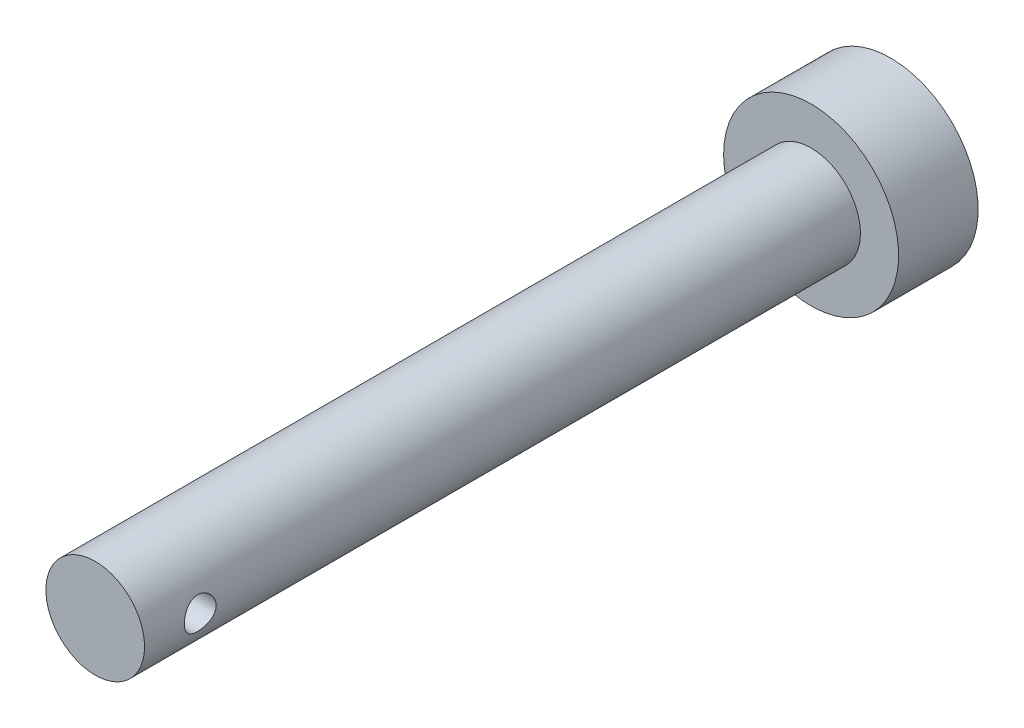
ISO-10303-21;
HEADER;
FILE_DESCRIPTION(('STEP AP214'),'2;1');
FILE_NAME('part.step','',(''),(''),'','','');
FILE_SCHEMA(('AUTOMOTIVE_DESIGN { 1 0 10303 214 1 1 1 1 }'));
ENDSEC;
DATA;
#1=APPLICATION_CONTEXT('core data for automotive mechanical design processes');
#2=APPLICATION_PROTOCOL_DEFINITION('international standard','automotive_design',2000,#1);
#3=PRODUCT_CONTEXT('',#1,'mechanical');
#4=PRODUCT('Part','Part','',(#3));
#5=PRODUCT_RELATED_PRODUCT_CATEGORY('part','',(#4));
#6=PRODUCT_DEFINITION_FORMATION('','',#4);
#7=PRODUCT_DEFINITION_CONTEXT('part definition',#1,'design');
#8=PRODUCT_DEFINITION('design','',#6,#7);
#9=PRODUCT_DEFINITION_SHAPE('','',#8);
#10=(LENGTH_UNIT() NAMED_UNIT(*) SI_UNIT(.MILLI.,.METRE.));
#11=(NAMED_UNIT(*) PLANE_ANGLE_UNIT() SI_UNIT($,.RADIAN.));
#12=(NAMED_UNIT(*) SI_UNIT($,.STERADIAN.) SOLID_ANGLE_UNIT());
#13=UNCERTAINTY_MEASURE_WITH_UNIT(LENGTH_MEASURE(1.E-05),#10,'distance_accuracy_value','');
#14=(GEOMETRIC_REPRESENTATION_CONTEXT(3) GLOBAL_UNCERTAINTY_ASSIGNED_CONTEXT((#13)) GLOBAL_UNIT_ASSIGNED_CONTEXT((#10,
#11,#12)) REPRESENTATION_CONTEXT('',''));
#15=CARTESIAN_POINT('',(0.,0.,0.));
#16=DIRECTION('',(0.,0.,1.));
#17=DIRECTION('',(1.,0.,0.));
#18=AXIS2_PLACEMENT_3D('',#15,#16,#17);
#19=CARTESIAN_POINT('',(0.,0.,45.));
#20=DIRECTION('',(0.,0.,-1.));
#21=DIRECTION('',(-1.,0.,0.));
#22=AXIS2_PLACEMENT_3D('',#19,#20,#21);
#23=CYLINDRICAL_SURFACE('',#22,3.1);
#24=CARTESIAN_POINT('',(-3.1,0.,40.5));
#25=CARTESIAN_POINT('',(-3.09999991732933,0.0546616928378481,40.5000000779756));
#26=CARTESIAN_POINT('',(-3.09854074383551,0.109324626027905,40.5044965335972));
#27=CARTESIAN_POINT('',(-3.09286313233695,0.217046394731187,40.5223126603245));
#28=CARTESIAN_POINT('',(-3.08864423243675,0.270104960165796,40.5356338084239));
#29=CARTESIAN_POINT('',(-3.07790688090447,0.373049270981988,40.5705994056249));
#30=CARTESIAN_POINT('',(-3.07139212676488,0.422939966664651,40.5922304765445));
#31=CARTESIAN_POINT('',(-3.05673203907304,0.518385805557841,40.643143276595));
#32=CARTESIAN_POINT('',(-3.04858641694504,0.563940179365319,40.6724263599999));
#33=CARTESIAN_POINT('',(-3.03122795920094,0.650909161248699,40.7388182781714));
#34=CARTESIAN_POINT('',(-3.02199075558346,0.692162305670849,40.776132218118));
#35=CARTESIAN_POINT('',(-3.00362795341575,0.767946996765762,40.8570902486727));
#36=CARTESIAN_POINT('',(-2.99450237775344,0.802477185933583,40.9007356146295));
#37=CARTESIAN_POINT('',(-2.97713144725325,0.864733161011551,40.9945418963536));
#38=CARTESIAN_POINT('',(-2.96891598960081,0.892253350457055,41.0448453251286));
#39=CARTESIAN_POINT('',(-2.95466389720521,0.938375319479866,41.1496742752733));
#40=CARTESIAN_POINT('',(-2.94862664562182,0.956979624412884,41.2041985960196));
#41=CARTESIAN_POINT('',(-2.9396702225274,0.984143780427318,41.3140926725762));
#42=CARTESIAN_POINT('',(-2.93665788132408,0.99300462017844,41.3693802171756));
#43=CARTESIAN_POINT('',(-2.93381620930014,1.00137095885894,41.4807329894575));
#44=CARTESIAN_POINT('',(-2.93398596783569,1.00087913430537,41.5367979900605));
#45=CARTESIAN_POINT('',(-2.93740735589061,0.99078869758625,41.645588119726));
#46=CARTESIAN_POINT('',(-2.94052787811318,0.981577483817591,41.6983540080824));
#47=CARTESIAN_POINT('',(-2.94928546572063,0.954939694345884,41.8015472010422));
#48=CARTESIAN_POINT('',(-2.95492281459322,0.937512193172744,41.8519742414985));
#49=CARTESIAN_POINT('',(-2.96817595683685,0.894672560822166,41.9499607400401));
#50=CARTESIAN_POINT('',(-2.97582076641868,0.869142073499799,41.9974643592104));
#51=CARTESIAN_POINT('',(-2.99221470175116,0.81090335738701,42.0876381018766));
#52=CARTESIAN_POINT('',(-3.00096412964128,0.778193162960507,42.1303068968505));
#53=CARTESIAN_POINT('',(-3.01910259490866,0.704641818516097,42.2117836911752));
#54=CARTESIAN_POINT('',(-3.0285020322448,0.663482313791419,42.2503025445807));
#55=CARTESIAN_POINT('',(-3.04650716560179,0.575171490035369,42.3199639150633));
#56=CARTESIAN_POINT('',(-3.05511279482185,0.52801966752911,42.3511058116976));
#57=CARTESIAN_POINT('',(-3.07066150642765,0.428478812163014,42.4053425591389));
#58=CARTESIAN_POINT('',(-3.07758933782193,0.376047454707776,42.4283644015228));
#59=CARTESIAN_POINT('',(-3.0888915225951,0.267780008434749,42.4651736095426));
#60=CARTESIAN_POINT('',(-3.09326670428871,0.211945030567731,42.4789639709356));
#61=CARTESIAN_POINT('',(-3.09883546017117,0.100906527818242,42.4964168420587));
#62=CARTESIAN_POINT('',(-3.10015181896368,0.0457705439581188,42.5004704348318));
#63=CARTESIAN_POINT('',(-3.09982018660884,-0.0644019846639804,42.4994427807207));
#64=CARTESIAN_POINT('',(-3.09817266024525,-0.119438543662587,42.4943629660982));
#65=CARTESIAN_POINT('',(-3.0921792527875,-0.226314427335924,42.4755245867189));
#66=CARTESIAN_POINT('',(-3.08790685930159,-0.278199907400526,42.462002223674));
#67=CARTESIAN_POINT('',(-3.07716867368517,-0.378948229242879,42.4269541884185));
#68=CARTESIAN_POINT('',(-3.07070260589543,-0.427810690232288,42.4054275103454));
#69=CARTESIAN_POINT('',(-3.05603411703274,-0.522504343922593,42.3543745150268));
#70=CARTESIAN_POINT('',(-3.04779185335867,-0.56822736703088,42.3246593322387));
#71=CARTESIAN_POINT('',(-3.03050981454519,-0.654167346628331,42.2582971311447));
#72=CARTESIAN_POINT('',(-3.02146981026828,-0.694382712615949,42.2216481177327));
#73=CARTESIAN_POINT('',(-3.00312715409019,-0.769937672744123,42.1406187524708));
#74=CARTESIAN_POINT('',(-2.99382961373558,-0.804998301572613,42.0959765142691));
#75=CARTESIAN_POINT('',(-2.97642049261311,-0.867160084432995,42.0012410266577));
#76=CARTESIAN_POINT('',(-2.96830890551494,-0.894261280951086,41.9511478063466));
#77=CARTESIAN_POINT('',(-2.95427571684034,-0.939584779805243,41.8469804192811));
#78=CARTESIAN_POINT('',(-2.94834741256436,-0.957834312467886,41.7929190582041));
#79=CARTESIAN_POINT('',(-2.93941897363932,-0.984897526937614,41.6822577537674));
#80=CARTESIAN_POINT('',(-2.93641762891512,-0.993715108285291,41.6256588696118));
#81=CARTESIAN_POINT('',(-2.93381458815353,-1.00137232277604,41.5144610481486));
#82=CARTESIAN_POINT('',(-2.93405610172574,-1.00067211468476,41.4598970953227));
#83=CARTESIAN_POINT('',(-2.93752743878588,-0.990434800076223,41.351706370633));
#84=CARTESIAN_POINT('',(-2.94075710520667,-0.980898158030969,41.2980795496614));
#85=CARTESIAN_POINT('',(-2.94972779399559,-0.953575367433496,41.1941676188352));
#86=CARTESIAN_POINT('',(-2.95542613218533,-0.935929134388619,41.1438417510491));
#87=CARTESIAN_POINT('',(-2.9686788226802,-0.892999646243258,41.0468254892021));
#88=CARTESIAN_POINT('',(-2.976233569577,-0.867714767236766,41.0001358708315));
#89=CARTESIAN_POINT('',(-2.99273704950311,-0.809005559218575,40.9096285081905));
#90=CARTESIAN_POINT('',(-3.00173047270294,-0.775288162939723,40.8660090505328));
#91=CARTESIAN_POINT('',(-3.01990141354045,-0.701177016271899,40.7848984488502));
#92=CARTESIAN_POINT('',(-3.02907898111945,-0.660781432603365,40.747408993255));
#93=CARTESIAN_POINT('',(-3.04697636303769,-0.572731312047682,40.6782816140783));
#94=CARTESIAN_POINT('',(-3.0556682369196,-0.524869500277994,40.6468996185803));
#95=CARTESIAN_POINT('',(-3.07125043822646,-0.424270928109886,40.5926650804752));
#96=CARTESIAN_POINT('',(-3.07814135769285,-0.371535777497287,40.5698097337792));
#97=CARTESIAN_POINT('',(-3.08896778011839,-0.266255500103288,40.534606875956));
#98=CARTESIAN_POINT('',(-3.09306744505299,-0.213924651837507,40.5216686224566));
#99=CARTESIAN_POINT('',(-3.09858327970547,-0.107729361043748,40.5043661557839));
#100=CARTESIAN_POINT('',(-3.10000008146617,-0.0538652827579416,40.4999999231605));
#101=CARTESIAN_POINT('',(-3.1,0.,40.5));
#102=B_SPLINE_CURVE_WITH_KNOTS('',3,(#24,#25,#26,#27,#28,#29,#30,#31,#32,#33,#34,#35,#36,#37,
#38,#39,#40,#41,#42,#43,#44,#45,#46,#47,#48,#49,#50,#51,#52,#53,#54,#55,#56,#57,#58,#59,#60,#61,
#62,#63,#64,#65,#66,#67,#68,#69,#70,#71,#72,#73,#74,#75,#76,#77,#78,#79,#80,#81,#82,#83,#84,#85,
#86,#87,#88,#89,#90,#91,#92,#93,#94,#95,#96,#97,#98,#99,#100,#101),.UNSPECIFIED.,.T.,.F.,(4,2,2,
2,2,2,2,2,2,2,2,2,2,2,2,2,2,2,2,2,2,2,2,2,2,2,2,2,2,2,2,2,2,2,2,2,2,2,4),(0.,0.163786977571213,
0.327601375188353,0.491153145030708,0.654733880339085,0.823132982457995,0.99156605268457,
1.16448270045611,1.33735034192778,1.50471321360198,1.67202819059899,1.8322419454362,
1.99247375081972,2.15516292888893,2.31789670313387,2.48855415146277,2.65922594793179,
2.83139534275185,3.00350883884293,3.16858437380868,3.33363402459453,3.49426103285019,
3.65490823313218,3.81962570567674,3.98439064549243,4.15614032639133,4.32788909050077,
4.49910609991181,4.67025229406715,4.83315473478927,4.9960486133097,5.15623187832752,
5.31644922082921,5.48328449671259,5.65016564808849,5.82298974464347,5.99575695575451,
6.15719562667167,6.31859626029481),.UNSPECIFIED.);
#103=CARTESIAN_POINT('',(-3.1,0.,40.5));
#104=VERTEX_POINT('',#103);
#105=EDGE_CURVE('E10',#104,#104,#102,.T.);
#106=ORIENTED_EDGE('',*,*,#105,.T.);
#107=EDGE_LOOP('',(#106));
#108=FACE_BOUND('',#107,.T.);
#109=CARTESIAN_POINT('',(3.1,0.,40.5));
#110=CARTESIAN_POINT('',(3.09999991732933,-0.0546616928378481,40.5000000779756));
#111=CARTESIAN_POINT('',(3.09854074383551,-0.109324626027905,40.5044965335972));
#112=CARTESIAN_POINT('',(3.09286313233695,-0.217046394731187,40.5223126603245));
#113=CARTESIAN_POINT('',(3.08864423243675,-0.270104960165796,40.5356338084239));
#114=CARTESIAN_POINT('',(3.07790688090447,-0.373049270981988,40.5705994056249));
#115=CARTESIAN_POINT('',(3.07139212676488,-0.422939966664651,40.5922304765445));
#116=CARTESIAN_POINT('',(3.05673203907304,-0.518385805557841,40.643143276595));
#117=CARTESIAN_POINT('',(3.04858641694504,-0.563940179365319,40.6724263599999));
#118=CARTESIAN_POINT('',(3.03122795920094,-0.650909161248698,40.7388182781714));
#119=CARTESIAN_POINT('',(3.02199075558346,-0.692162305670847,40.776132218118));
#120=CARTESIAN_POINT('',(3.00362795341575,-0.767946996765761,40.8570902486727));
#121=CARTESIAN_POINT('',(2.99450237775344,-0.802477185933582,40.9007356146295));
#122=CARTESIAN_POINT('',(2.97713144725325,-0.86473316101155,40.9945418963536));
#123=CARTESIAN_POINT('',(2.96891598960081,-0.892253350457055,41.0448453251286));
#124=CARTESIAN_POINT('',(2.95466389720521,-0.938375319479866,41.1496742752733));
#125=CARTESIAN_POINT('',(2.94862664562182,-0.956979624412884,41.2041985960196));
#126=CARTESIAN_POINT('',(2.9396702225274,-0.984143780427318,41.3140926725762));
#127=CARTESIAN_POINT('',(2.93665788132408,-0.99300462017844,41.3693802171756));
#128=CARTESIAN_POINT('',(2.93381620930014,-1.00137095885894,41.4807329894575));
#129=CARTESIAN_POINT('',(2.93398596783569,-1.00087913430537,41.5367979900605));
#130=CARTESIAN_POINT('',(2.93740735589061,-0.99078869758625,41.645588119726));
#131=CARTESIAN_POINT('',(2.94052787811318,-0.981577483817591,41.6983540080824));
#132=CARTESIAN_POINT('',(2.94928546572063,-0.954939694345884,41.8015472010422));
#133=CARTESIAN_POINT('',(2.95492281459322,-0.937512193172744,41.8519742414985));
#134=CARTESIAN_POINT('',(2.96817595683685,-0.894672560822166,41.9499607400401));
#135=CARTESIAN_POINT('',(2.97582076641868,-0.869142073499799,41.9974643592104));
#136=CARTESIAN_POINT('',(2.99221470175116,-0.81090335738701,42.0876381018766));
#137=CARTESIAN_POINT('',(3.00096412964128,-0.778193162960507,42.1303068968505));
#138=CARTESIAN_POINT('',(3.01910259490866,-0.704641818516097,42.2117836911752));
#139=CARTESIAN_POINT('',(3.0285020322448,-0.663482313791419,42.2503025445807));
#140=CARTESIAN_POINT('',(3.04650716560179,-0.575171490035369,42.3199639150633));
#141=CARTESIAN_POINT('',(3.05511279482185,-0.52801966752911,42.3511058116976));
#142=CARTESIAN_POINT('',(3.07066150642765,-0.428478812163014,42.4053425591389));
#143=CARTESIAN_POINT('',(3.07758933782193,-0.376047454707776,42.4283644015228));
#144=CARTESIAN_POINT('',(3.0888915225951,-0.267780008434749,42.4651736095426));
#145=CARTESIAN_POINT('',(3.09326670428871,-0.211945030567731,42.4789639709356));
#146=CARTESIAN_POINT('',(3.09883546017117,-0.100906527818242,42.4964168420587));
#147=CARTESIAN_POINT('',(3.10015181896368,-0.0457705439581188,42.5004704348318));
#148=CARTESIAN_POINT('',(3.09982018660884,0.0644019846639804,42.4994427807207));
#149=CARTESIAN_POINT('',(3.09817266024525,0.119438543662587,42.4943629660982));
#150=CARTESIAN_POINT('',(3.0921792527875,0.226314427335924,42.4755245867189));
#151=CARTESIAN_POINT('',(3.08790685930159,0.278199907400526,42.462002223674));
#152=CARTESIAN_POINT('',(3.07716867368517,0.378948229242879,42.4269541884185));
#153=CARTESIAN_POINT('',(3.07070260589543,0.427810690232288,42.4054275103454));
#154=CARTESIAN_POINT('',(3.05603411703274,0.522504343922593,42.3543745150268));
#155=CARTESIAN_POINT('',(3.04779185335867,0.56822736703088,42.3246593322387));
#156=CARTESIAN_POINT('',(3.03050981454519,0.654167346628331,42.2582971311447));
#157=CARTESIAN_POINT('',(3.02146981026828,0.694382712615949,42.2216481177327));
#158=CARTESIAN_POINT('',(3.00312715409019,0.769937672744123,42.1406187524708));
#159=CARTESIAN_POINT('',(2.99382961373558,0.804998301572613,42.0959765142691));
#160=CARTESIAN_POINT('',(2.97642049261311,0.867160084432995,42.0012410266577));
#161=CARTESIAN_POINT('',(2.96830890551494,0.894261280951086,41.9511478063466));
#162=CARTESIAN_POINT('',(2.95427571684034,0.939584779805243,41.8469804192811));
#163=CARTESIAN_POINT('',(2.94834741256436,0.957834312467886,41.7929190582041));
#164=CARTESIAN_POINT('',(2.93941897363932,0.984897526937614,41.6822577537674));
#165=CARTESIAN_POINT('',(2.93641762891512,0.993715108285291,41.6256588696118));
#166=CARTESIAN_POINT('',(2.93381458815353,1.00137232277604,41.5144610481486));
#167=CARTESIAN_POINT('',(2.93405610172574,1.00067211468476,41.4598970953227));
#168=CARTESIAN_POINT('',(2.93752743878588,0.990434800076223,41.351706370633));
#169=CARTESIAN_POINT('',(2.94075710520667,0.980898158030969,41.2980795496614));
#170=CARTESIAN_POINT('',(2.94972779399559,0.953575367433496,41.1941676188352));
#171=CARTESIAN_POINT('',(2.95542613218533,0.935929134388619,41.1438417510491));
#172=CARTESIAN_POINT('',(2.9686788226802,0.892999646243258,41.0468254892021));
#173=CARTESIAN_POINT('',(2.976233569577,0.867714767236766,41.0001358708315));
#174=CARTESIAN_POINT('',(2.99273704950311,0.809005559218575,40.9096285081905));
#175=CARTESIAN_POINT('',(3.00173047270294,0.775288162939723,40.8660090505328));
#176=CARTESIAN_POINT('',(3.01990141354045,0.701177016271899,40.7848984488502));
#177=CARTESIAN_POINT('',(3.02907898111945,0.660781432603365,40.747408993255));
#178=CARTESIAN_POINT('',(3.04697636303769,0.572731312047682,40.6782816140783));
#179=CARTESIAN_POINT('',(3.0556682369196,0.524869500277994,40.6468996185803));
#180=CARTESIAN_POINT('',(3.07125043822646,0.424270928109886,40.5926650804752));
#181=CARTESIAN_POINT('',(3.07814135769285,0.371535777497287,40.5698097337792));
#182=CARTESIAN_POINT('',(3.08896778011839,0.266255500103288,40.534606875956));
#183=CARTESIAN_POINT('',(3.09306744505299,0.213924651837507,40.5216686224566));
#184=CARTESIAN_POINT('',(3.09858327970547,0.107729361043748,40.5043661557839));
#185=CARTESIAN_POINT('',(3.10000008146617,0.0538652827579416,40.4999999231605));
#186=CARTESIAN_POINT('',(3.1,0.,40.5));
#187=B_SPLINE_CURVE_WITH_KNOTS('',3,(#109,#110,#111,#112,#113,#114,#115,#116,#117,#118,#119,
#120,#121,#122,#123,#124,#125,#126,#127,#128,#129,#130,#131,#132,#133,#134,#135,#136,#137,#138,
#139,#140,#141,#142,#143,#144,#145,#146,#147,#148,#149,#150,#151,#152,#153,#154,#155,#156,#157,
#158,#159,#160,#161,#162,#163,#164,#165,#166,#167,#168,#169,#170,#171,#172,#173,#174,#175,#176,
#177,#178,#179,#180,#181,#182,#183,#184,#185,#186),.UNSPECIFIED.,.T.,.F.,(4,2,2,2,2,2,2,2,2,2,2,
2,2,2,2,2,2,2,2,2,2,2,2,2,2,2,2,2,2,2,2,2,2,2,2,2,2,2,4),(0.,0.163786977571213,
0.327601375188353,0.491153145030708,0.654733880339085,0.823132982457988,0.99156605268457,
1.16448270045612,1.33735034192778,1.50471321360198,1.67202819059899,1.8322419454362,
1.99247375081972,2.15516292888893,2.31789670313387,2.48855415146277,2.65922594793179,
2.83139534275185,3.00350883884293,3.16858437380868,3.33363402459453,3.49426103285019,
3.65490823313218,3.81962570567674,3.98439064549243,4.15614032639133,4.32788909050077,
4.49910609991181,4.67025229406715,4.83315473478927,4.9960486133097,5.15623187832752,
5.31644922082921,5.48328449671259,5.65016564808849,5.82298974464347,5.99575695575451,
6.15719562667167,6.31859626029481),.UNSPECIFIED.);
#188=CARTESIAN_POINT('',(3.1,0.,40.5));
#189=VERTEX_POINT('',#188);
#190=EDGE_CURVE('E55',#189,#189,#187,.T.);
#191=ORIENTED_EDGE('',*,*,#190,.T.);
#192=EDGE_LOOP('',(#191));
#193=FACE_BOUND('',#192,.T.);
#194=CARTESIAN_POINT('',(0.,0.,45.));
#195=DIRECTION('',(0.,0.,1.));
#196=DIRECTION('',(1.,0.,0.));
#197=AXIS2_PLACEMENT_3D('',#194,#195,#196);
#198=CIRCLE('',#197,3.1);
#199=CARTESIAN_POINT('',(3.1,0.,45.));
#200=VERTEX_POINT('',#199);
#201=EDGE_CURVE('E60',#200,#200,#198,.T.);
#202=ORIENTED_EDGE('',*,*,#201,.F.);
#203=EDGE_LOOP('',(#202));
#204=FACE_BOUND('',#203,.T.);
#205=CARTESIAN_POINT('',(0.,0.,0.));
#206=DIRECTION('',(0.,0.,1.));
#207=DIRECTION('',(1.,0.,0.));
#208=AXIS2_PLACEMENT_3D('',#205,#206,#207);
#209=CIRCLE('',#208,3.1);
#210=CARTESIAN_POINT('',(3.1,0.,0.));
#211=VERTEX_POINT('',#210);
#212=EDGE_CURVE('E65',#211,#211,#209,.T.);
#213=ORIENTED_EDGE('',*,*,#212,.T.);
#214=EDGE_LOOP('',(#213));
#215=FACE_BOUND('',#214,.T.);
#216=ADVANCED_FACE('F43',(#108,#193,#204,#215),#23,.T.);
#217=CARTESIAN_POINT('',(0.,0.,45.));
#218=DIRECTION('',(0.,0.,1.));
#219=DIRECTION('',(1.,0.,0.));
#220=AXIS2_PLACEMENT_3D('',#217,#218,#219);
#221=PLANE('',#220);
#222=ORIENTED_EDGE('',*,*,#201,.T.);
#223=EDGE_LOOP('',(#222));
#224=FACE_BOUND('',#223,.T.);
#225=ADVANCED_FACE('F76',(#224),#221,.T.);
#226=CARTESIAN_POINT('',(-3.1,0.,41.5));
#227=DIRECTION('',(1.,0.,0.));
#228=DIRECTION('',(0.,0.,-1.));
#229=AXIS2_PLACEMENT_3D('',#226,#227,#228);
#230=CYLINDRICAL_SURFACE('',#229,0.999999999999998);
#231=ORIENTED_EDGE('',*,*,#190,.F.);
#232=EDGE_LOOP('',(#231));
#233=FACE_BOUND('',#232,.T.);
#234=ORIENTED_EDGE('',*,*,#105,.F.);
#235=EDGE_LOOP('',(#234));
#236=FACE_BOUND('',#235,.T.);
#237=ADVANCED_FACE('F71',(#233,#236),#230,.F.);
#238=CARTESIAN_POINT('',(0.,0.,-5.));
#239=DIRECTION('',(0.,0.,1.));
#240=DIRECTION('',(1.,0.,0.));
#241=AXIS2_PLACEMENT_3D('',#238,#239,#240);
#242=CYLINDRICAL_SURFACE('',#241,5.5);
#243=CARTESIAN_POINT('',(0.,0.,-5.));
#244=DIRECTION('',(0.,0.,-1.));
#245=DIRECTION('',(-1.,0.,0.));
#246=AXIS2_PLACEMENT_3D('',#243,#244,#245);
#247=CIRCLE('',#246,5.5);
#248=CARTESIAN_POINT('',(-5.5,0.,-5.));
#249=VERTEX_POINT('',#248);
#250=EDGE_CURVE('E92',#249,#249,#247,.T.);
#251=ORIENTED_EDGE('',*,*,#250,.F.);
#252=EDGE_LOOP('',(#251));
#253=FACE_BOUND('',#252,.T.);
#254=CARTESIAN_POINT('',(0.,0.,0.));
#255=DIRECTION('',(0.,0.,-1.));
#256=DIRECTION('',(-1.,0.,0.));
#257=AXIS2_PLACEMENT_3D('',#254,#255,#256);
#258=CIRCLE('',#257,5.5);
#259=CARTESIAN_POINT('',(-5.5,0.,0.));
#260=VERTEX_POINT('',#259);
#261=EDGE_CURVE('E95',#260,#260,#258,.T.);
#262=ORIENTED_EDGE('',*,*,#261,.T.);
#263=EDGE_LOOP('',(#262));
#264=FACE_BOUND('',#263,.T.);
#265=ADVANCED_FACE('F75',(#253,#264),#242,.T.);
#266=CARTESIAN_POINT('',(0.,0.,-5.));
#267=DIRECTION('',(0.,0.,-1.));
#268=DIRECTION('',(-1.,0.,0.));
#269=AXIS2_PLACEMENT_3D('',#266,#267,#268);
#270=PLANE('',#269);
#271=ORIENTED_EDGE('',*,*,#250,.T.);
#272=EDGE_LOOP('',(#271));
#273=FACE_BOUND('',#272,.T.);
#274=ADVANCED_FACE('F107',(#273),#270,.T.);
#275=CARTESIAN_POINT('',(0.,0.,0.));
#276=DIRECTION('',(0.,0.,-1.));
#277=DIRECTION('',(-1.,0.,0.));
#278=AXIS2_PLACEMENT_3D('',#275,#276,#277);
#279=PLANE('',#278);
#280=ORIENTED_EDGE('',*,*,#212,.F.);
#281=EDGE_LOOP('',(#280));
#282=FACE_BOUND('',#281,.T.);
#283=ORIENTED_EDGE('',*,*,#261,.F.);
#284=EDGE_LOOP('',(#283));
#285=FACE_BOUND('',#284,.T.);
#286=ADVANCED_FACE('F105',(#282,#285),#279,.F.);
#287=CLOSED_SHELL('',(#216,#225,#237,#265,#274,#286));
#288=MANIFOLD_SOLID_BREP('B2',#287);
#289=ADVANCED_BREP_SHAPE_REPRESENTATION('',(#18,#288),#14);
#290=SHAPE_DEFINITION_REPRESENTATION(#9,#289);
ENDSEC;
END-ISO-10303-21;
